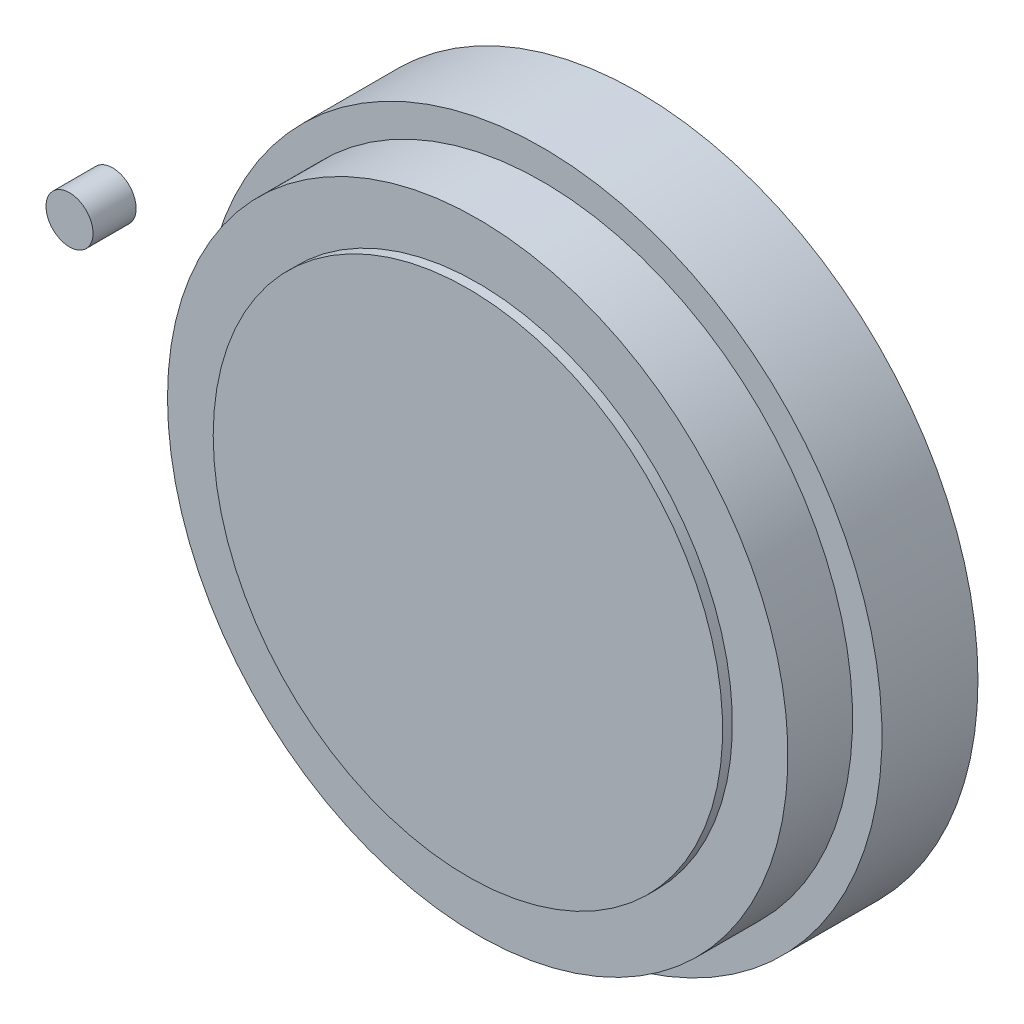
ISO-10303-21;
HEADER;
FILE_DESCRIPTION(('STEP AP214'),'2;1');
FILE_NAME('part.step','',(''),(''),'','','');
FILE_SCHEMA(('AUTOMOTIVE_DESIGN { 1 0 10303 214 1 1 1 1 }'));
ENDSEC;
DATA;
#1=APPLICATION_CONTEXT('core data for automotive mechanical design processes');
#2=APPLICATION_PROTOCOL_DEFINITION('international standard','automotive_design',2000,#1);
#3=PRODUCT_CONTEXT('',#1,'mechanical');
#4=PRODUCT('Part','Part','',(#3));
#5=PRODUCT_RELATED_PRODUCT_CATEGORY('part','',(#4));
#6=PRODUCT_DEFINITION_FORMATION('','',#4);
#7=PRODUCT_DEFINITION_CONTEXT('part definition',#1,'design');
#8=PRODUCT_DEFINITION('design','',#6,#7);
#9=PRODUCT_DEFINITION_SHAPE('','',#8);
#10=(LENGTH_UNIT() NAMED_UNIT(*) SI_UNIT(.MILLI.,.METRE.));
#11=(NAMED_UNIT(*) PLANE_ANGLE_UNIT() SI_UNIT($,.RADIAN.));
#12=(NAMED_UNIT(*) SI_UNIT($,.STERADIAN.) SOLID_ANGLE_UNIT());
#13=UNCERTAINTY_MEASURE_WITH_UNIT(LENGTH_MEASURE(1.E-05),#10,'distance_accuracy_value','');
#14=(GEOMETRIC_REPRESENTATION_CONTEXT(3) GLOBAL_UNCERTAINTY_ASSIGNED_CONTEXT((#13)) GLOBAL_UNIT_ASSIGNED_CONTEXT((#10,
#11,#12)) REPRESENTATION_CONTEXT('',''));
#15=CARTESIAN_POINT('',(0.,0.,0.));
#16=DIRECTION('',(0.,0.,1.));
#17=DIRECTION('',(1.,0.,0.));
#18=AXIS2_PLACEMENT_3D('',#15,#16,#17);
#19=CARTESIAN_POINT('',(0.,0.,135.));
#20=DIRECTION('',(0.,0.,1.));
#21=DIRECTION('',(-1.,0.,0.));
#22=AXIS2_PLACEMENT_3D('',#19,#20,#21);
#23=CYLINDRICAL_SURFACE('',#22,260.);
#24=CARTESIAN_POINT('',(-6.03471579158286E-13,0.,282.));
#25=DIRECTION('',(0.,0.,1.));
#26=DIRECTION('',(-1.,0.,0.));
#27=AXIS2_PLACEMENT_3D('',#24,#25,#26);
#28=CIRCLE('',#27,260.);
#29=CARTESIAN_POINT('',(-260.000000000001,0.,281.999999999999));
#30=VERTEX_POINT('',#29);
#31=EDGE_CURVE('E34',#30,#30,#28,.T.);
#32=ORIENTED_EDGE('',*,*,#31,.F.);
#33=EDGE_LOOP('',(#32));
#34=FACE_BOUND('',#33,.T.);
#35=CARTESIAN_POINT('',(-3.09235789579143E-13,0.,208.5));
#36=DIRECTION('',(0.,0.,1.));
#37=DIRECTION('',(1.,0.,0.));
#38=AXIS2_PLACEMENT_3D('',#35,#36,#37);
#39=CIRCLE('',#38,260.);
#40=CARTESIAN_POINT('',(260.,0.,208.5));
#41=VERTEX_POINT('',#40);
#42=EDGE_CURVE('E56',#41,#41,#39,.F.);
#43=ORIENTED_EDGE('',*,*,#42,.F.);
#44=EDGE_LOOP('',(#43));
#45=FACE_BOUND('',#44,.T.);
#46=ADVANCED_FACE('F62',(#34,#45),#23,.T.);
#47=CARTESIAN_POINT('',(263.12,-263.12,282.));
#48=DIRECTION('',(0.,0.,1.));
#49=DIRECTION('',(0.,1.,0.));
#50=AXIS2_PLACEMENT_3D('',#47,#48,#49);
#51=PLANE('',#50);
#52=CARTESIAN_POINT('',(-1.16358291009441E-13,0.,282.));
#53=DIRECTION('',(0.,0.,1.));
#54=DIRECTION('',(-1.,0.,0.));
#55=AXIS2_PLACEMENT_3D('',#52,#53,#54);
#56=CIRCLE('',#55,237.5);
#57=CARTESIAN_POINT('',(-237.5,0.,281.999999999999));
#58=VERTEX_POINT('',#57);
#59=EDGE_CURVE('E37',#58,#58,#56,.T.);
#60=ORIENTED_EDGE('',*,*,#59,.F.);
#61=EDGE_LOOP('',(#60));
#62=FACE_BOUND('',#61,.T.);
#63=ORIENTED_EDGE('',*,*,#31,.T.);
#64=EDGE_LOOP('',(#63));
#65=FACE_BOUND('',#64,.T.);
#66=ADVANCED_FACE('F64',(#62,#65),#51,.T.);
#67=CARTESIAN_POINT('',(0.,0.,232.5));
#68=DIRECTION('',(0.,0.,1.));
#69=DIRECTION('',(-1.,0.,0.));
#70=AXIS2_PLACEMENT_3D('',#67,#68,#69);
#71=CYLINDRICAL_SURFACE('',#70,237.5);
#72=CARTESIAN_POINT('',(-2.27716582018883E-13,0.,331.5));
#73=DIRECTION('',(0.,0.,1.));
#74=DIRECTION('',(-1.,0.,0.));
#75=AXIS2_PLACEMENT_3D('',#72,#73,#74);
#76=CIRCLE('',#75,237.5);
#77=CARTESIAN_POINT('',(-237.5,0.,331.499999999999));
#78=VERTEX_POINT('',#77);
#79=EDGE_CURVE('E43',#78,#78,#76,.T.);
#80=ORIENTED_EDGE('',*,*,#79,.F.);
#81=EDGE_LOOP('',(#80));
#82=FACE_BOUND('',#81,.T.);
#83=ORIENTED_EDGE('',*,*,#59,.T.);
#84=EDGE_LOOP('',(#83));
#85=FACE_BOUND('',#84,.T.);
#86=ADVANCED_FACE('F73',(#82,#85),#71,.T.);
#87=CARTESIAN_POINT('',(240.35,-240.35,331.5));
#88=DIRECTION('',(0.,0.,1.));
#89=DIRECTION('',(0.,1.,0.));
#90=AXIS2_PLACEMENT_3D('',#87,#88,#89);
#91=PLANE('',#90);
#92=CARTESIAN_POINT('',(0.,0.,331.5));
#93=DIRECTION('',(0.,0.,1.));
#94=DIRECTION('',(-1.,0.,0.));
#95=AXIS2_PLACEMENT_3D('',#92,#93,#94);
#96=CIRCLE('',#95,195.);
#97=CARTESIAN_POINT('',(-195.,0.,331.5));
#98=VERTEX_POINT('',#97);
#99=EDGE_CURVE('E29',#98,#98,#96,.T.);
#100=ORIENTED_EDGE('',*,*,#99,.F.);
#101=EDGE_LOOP('',(#100));
#102=FACE_BOUND('',#101,.T.);
#103=ORIENTED_EDGE('',*,*,#79,.T.);
#104=EDGE_LOOP('',(#103));
#105=FACE_BOUND('',#104,.T.);
#106=ADVANCED_FACE('F88',(#102,#105),#91,.T.);
#107=CARTESIAN_POINT('',(197.34,-197.34,339.));
#108=DIRECTION('',(0.,0.,1.));
#109=DIRECTION('',(0.,1.,0.));
#110=AXIS2_PLACEMENT_3D('',#107,#108,#109);
#111=PLANE('',#110);
#112=CARTESIAN_POINT('',(0.,0.,339.));
#113=DIRECTION('',(0.,0.,1.));
#114=DIRECTION('',(-1.,0.,0.));
#115=AXIS2_PLACEMENT_3D('',#112,#113,#114);
#116=CIRCLE('',#115,195.);
#117=CARTESIAN_POINT('',(-195.,0.,339.));
#118=VERTEX_POINT('',#117);
#119=EDGE_CURVE('E25',#118,#118,#116,.F.);
#120=ORIENTED_EDGE('',*,*,#119,.F.);
#121=EDGE_LOOP('',(#120));
#122=FACE_BOUND('',#121,.T.);
#123=ADVANCED_FACE('F82',(#122),#111,.T.);
#124=CARTESIAN_POINT('',(0.,0.,324.));
#125=DIRECTION('',(0.,0.,1.));
#126=DIRECTION('',(-1.,0.,0.));
#127=AXIS2_PLACEMENT_3D('',#124,#125,#126);
#128=CYLINDRICAL_SURFACE('',#127,195.);
#129=ORIENTED_EDGE('',*,*,#119,.T.);
#130=EDGE_LOOP('',(#129));
#131=FACE_BOUND('',#130,.T.);
#132=ORIENTED_EDGE('',*,*,#99,.T.);
#133=EDGE_LOOP('',(#132));
#134=FACE_BOUND('',#133,.T.);
#135=ADVANCED_FACE('F79',(#131,#134),#128,.T.);
#136=CARTESIAN_POINT('',(0.,0.,208.5));
#137=DIRECTION('',(0.,0.,1.));
#138=DIRECTION('',(1.,0.,0.));
#139=AXIS2_PLACEMENT_3D('',#136,#137,#138);
#140=PLANE('',#139);
#141=ORIENTED_EDGE('',*,*,#42,.T.);
#142=EDGE_LOOP('',(#141));
#143=FACE_BOUND('',#142,.T.);
#144=ADVANCED_FACE('F60',(#143),#140,.F.);
#145=CLOSED_SHELL('',(#46,#66,#86,#106,#123,#135,#144));
#146=MANIFOLD_SOLID_BREP('B1',#145);
#147=CARTESIAN_POINT('',(-411.216,-18.2159999999996,251.));
#148=DIRECTION('',(0.,0.,1.));
#149=DIRECTION('',(1.,0.,0.));
#150=AXIS2_PLACEMENT_3D('',#147,#148,#149);
#151=PLANE('',#150);
#152=CARTESIAN_POINT('',(-393.,3.46944695195362E-13,251.));
#153=DIRECTION('',(0.,0.,-1.));
#154=DIRECTION('',(0.,1.,0.));
#155=AXIS2_PLACEMENT_3D('',#152,#153,#154);
#156=CIRCLE('',#155,18.);
#157=CARTESIAN_POINT('',(-393.,18.0000000000003,251.));
#158=VERTEX_POINT('',#157);
#159=EDGE_CURVE('E10',#158,#158,#156,.T.);
#160=ORIENTED_EDGE('',*,*,#159,.F.);
#161=EDGE_LOOP('',(#160));
#162=FACE_BOUND('',#161,.T.);
#163=ADVANCED_FACE('F16',(#162),#151,.T.);
#164=CARTESIAN_POINT('',(-393.,3.95516952522712E-13,284.));
#165=DIRECTION('',(0.,0.,-1.));
#166=DIRECTION('',(0.,1.,0.));
#167=AXIS2_PLACEMENT_3D('',#164,#165,#166);
#168=CYLINDRICAL_SURFACE('',#167,18.);
#169=CARTESIAN_POINT('',(-393.,3.44631730560726E-13,218.));
#170=DIRECTION('',(0.,0.,1.));
#171=DIRECTION('',(1.,0.,0.));
#172=AXIS2_PLACEMENT_3D('',#169,#170,#171);
#173=CIRCLE('',#172,18.);
#174=CARTESIAN_POINT('',(-375.,3.44631730560726E-13,218.));
#175=VERTEX_POINT('',#174);
#176=EDGE_CURVE('E38',#175,#175,#173,.F.);
#177=ORIENTED_EDGE('',*,*,#176,.F.);
#178=EDGE_LOOP('',(#177));
#179=FACE_BOUND('',#178,.T.);
#180=ORIENTED_EDGE('',*,*,#159,.T.);
#181=EDGE_LOOP('',(#180));
#182=FACE_BOUND('',#181,.T.);
#183=ADVANCED_FACE('F18',(#179,#182),#168,.T.);
#184=CARTESIAN_POINT('',(0.,0.,218.));
#185=DIRECTION('',(0.,0.,1.));
#186=DIRECTION('',(1.,0.,0.));
#187=AXIS2_PLACEMENT_3D('',#184,#185,#186);
#188=PLANE('',#187);
#189=ORIENTED_EDGE('',*,*,#176,.T.);
#190=EDGE_LOOP('',(#189));
#191=FACE_BOUND('',#190,.T.);
#192=ADVANCED_FACE('F98',(#191),#188,.F.);
#193=CLOSED_SHELL('',(#163,#183,#192));
#194=MANIFOLD_SOLID_BREP('B1',#193);
#195=ADVANCED_BREP_SHAPE_REPRESENTATION('',(#18,#146,#194),#14);
#196=SHAPE_DEFINITION_REPRESENTATION(#9,#195);
ENDSEC;
END-ISO-10303-21;
